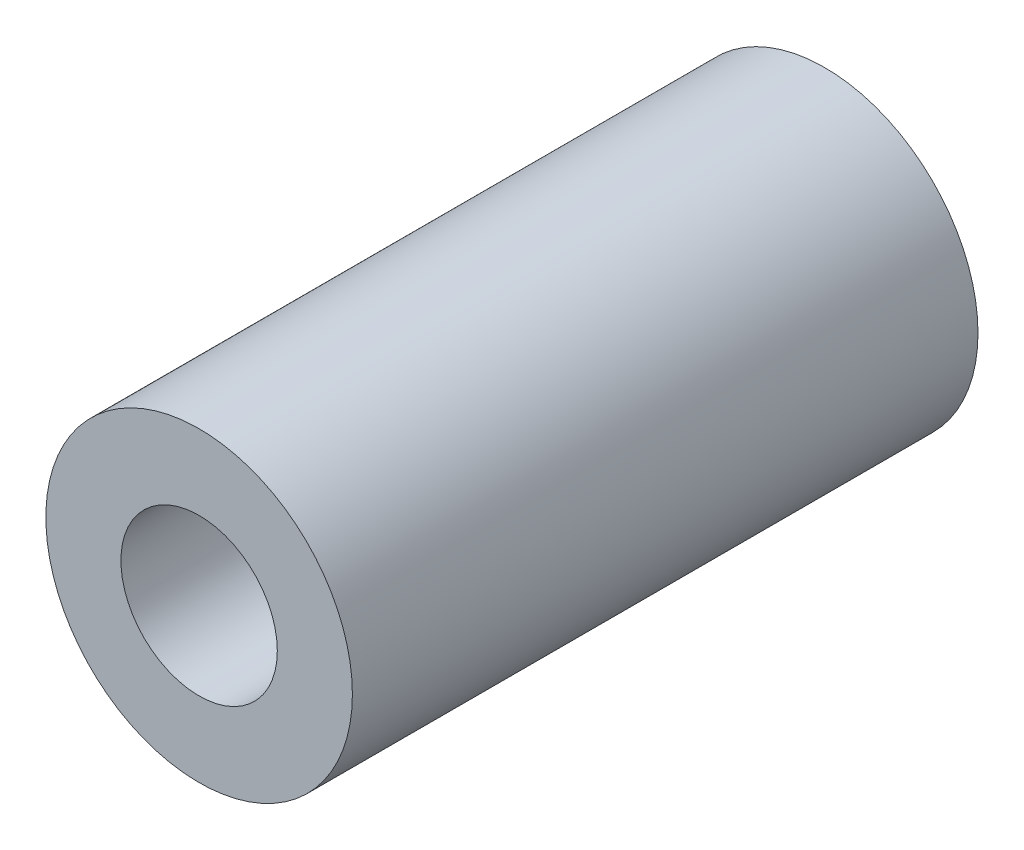
ISO-10303-21;
HEADER;
FILE_DESCRIPTION(('STEP AP214'),'2;1');
FILE_NAME('part.step','',(''),(''),'','','');
FILE_SCHEMA(('AUTOMOTIVE_DESIGN { 1 0 10303 214 1 1 1 1 }'));
ENDSEC;
DATA;
#1=APPLICATION_CONTEXT('core data for automotive mechanical design processes');
#2=APPLICATION_PROTOCOL_DEFINITION('international standard','automotive_design',2000,#1);
#3=PRODUCT_CONTEXT('',#1,'mechanical');
#4=PRODUCT('Part','Part','',(#3));
#5=PRODUCT_RELATED_PRODUCT_CATEGORY('part','',(#4));
#6=PRODUCT_DEFINITION_FORMATION('','',#4);
#7=PRODUCT_DEFINITION_CONTEXT('part definition',#1,'design');
#8=PRODUCT_DEFINITION('design','',#6,#7);
#9=PRODUCT_DEFINITION_SHAPE('','',#8);
#10=(LENGTH_UNIT() NAMED_UNIT(*) SI_UNIT(.MILLI.,.METRE.));
#11=(NAMED_UNIT(*) PLANE_ANGLE_UNIT() SI_UNIT($,.RADIAN.));
#12=(NAMED_UNIT(*) SI_UNIT($,.STERADIAN.) SOLID_ANGLE_UNIT());
#13=UNCERTAINTY_MEASURE_WITH_UNIT(LENGTH_MEASURE(1.E-05),#10,'distance_accuracy_value','');
#14=(GEOMETRIC_REPRESENTATION_CONTEXT(3) GLOBAL_UNCERTAINTY_ASSIGNED_CONTEXT((#13)) GLOBAL_UNIT_ASSIGNED_CONTEXT((#10,
#11,#12)) REPRESENTATION_CONTEXT('',''));
#15=CARTESIAN_POINT('',(0.,0.,0.));
#16=DIRECTION('',(0.,0.,1.));
#17=DIRECTION('',(1.,0.,0.));
#18=AXIS2_PLACEMENT_3D('',#15,#16,#17);
#19=CARTESIAN_POINT('',(0.,0.,10.));
#20=DIRECTION('',(0.,0.,1.));
#21=DIRECTION('',(1.,0.,0.));
#22=AXIS2_PLACEMENT_3D('',#19,#20,#21);
#23=PLANE('',#22);
#24=CARTESIAN_POINT('',(0.,0.,10.));
#25=DIRECTION('',(0.,0.,1.));
#26=DIRECTION('',(1.,0.,0.));
#27=AXIS2_PLACEMENT_3D('',#24,#25,#26);
#28=CIRCLE('',#27,2.45);
#29=CARTESIAN_POINT('',(2.45,0.,10.));
#30=VERTEX_POINT('',#29);
#31=EDGE_CURVE('E10',#30,#30,#28,.T.);
#32=ORIENTED_EDGE('',*,*,#31,.T.);
#33=EDGE_LOOP('',(#32));
#34=FACE_BOUND('',#33,.T.);
#35=CARTESIAN_POINT('',(0.,0.,10.));
#36=DIRECTION('',(0.,0.,1.));
#37=DIRECTION('',(1.,0.,0.));
#38=AXIS2_PLACEMENT_3D('',#35,#36,#37);
#39=CIRCLE('',#38,1.25);
#40=CARTESIAN_POINT('',(1.25,0.,10.));
#41=VERTEX_POINT('',#40);
#42=EDGE_CURVE('E48',#41,#41,#39,.T.);
#43=ORIENTED_EDGE('',*,*,#42,.F.);
#44=EDGE_LOOP('',(#43));
#45=FACE_BOUND('',#44,.T.);
#46=ADVANCED_FACE('F37',(#34,#45),#23,.T.);
#47=CARTESIAN_POINT('',(0.,0.,0.));
#48=DIRECTION('',(0.,0.,1.));
#49=DIRECTION('',(1.,0.,0.));
#50=AXIS2_PLACEMENT_3D('',#47,#48,#49);
#51=PLANE('',#50);
#52=CARTESIAN_POINT('',(0.,0.,0.));
#53=DIRECTION('',(0.,0.,1.));
#54=DIRECTION('',(1.,0.,0.));
#55=AXIS2_PLACEMENT_3D('',#52,#53,#54);
#56=CIRCLE('',#55,2.45);
#57=CARTESIAN_POINT('',(2.45,0.,0.));
#58=VERTEX_POINT('',#57);
#59=EDGE_CURVE('E41',#58,#58,#56,.T.);
#60=ORIENTED_EDGE('',*,*,#59,.F.);
#61=EDGE_LOOP('',(#60));
#62=FACE_BOUND('',#61,.T.);
#63=CARTESIAN_POINT('',(0.,0.,0.));
#64=DIRECTION('',(0.,0.,1.));
#65=DIRECTION('',(1.,0.,0.));
#66=AXIS2_PLACEMENT_3D('',#63,#64,#65);
#67=CIRCLE('',#66,1.25);
#68=CARTESIAN_POINT('',(1.25,0.,0.));
#69=VERTEX_POINT('',#68);
#70=EDGE_CURVE('E50',#69,#69,#67,.T.);
#71=ORIENTED_EDGE('',*,*,#70,.T.);
#72=EDGE_LOOP('',(#71));
#73=FACE_BOUND('',#72,.T.);
#74=ADVANCED_FACE('F60',(#62,#73),#51,.F.);
#75=CARTESIAN_POINT('',(0.,0.,10.));
#76=DIRECTION('',(0.,0.,-1.));
#77=DIRECTION('',(-1.,0.,0.));
#78=AXIS2_PLACEMENT_3D('',#75,#76,#77);
#79=CYLINDRICAL_SURFACE('',#78,2.45);
#80=ORIENTED_EDGE('',*,*,#31,.F.);
#81=EDGE_LOOP('',(#80));
#82=FACE_BOUND('',#81,.T.);
#83=ORIENTED_EDGE('',*,*,#59,.T.);
#84=EDGE_LOOP('',(#83));
#85=FACE_BOUND('',#84,.T.);
#86=ADVANCED_FACE('F39',(#82,#85),#79,.T.);
#87=CARTESIAN_POINT('',(0.,0.,10.));
#88=DIRECTION('',(0.,0.,-1.));
#89=DIRECTION('',(-1.,0.,0.));
#90=AXIS2_PLACEMENT_3D('',#87,#88,#89);
#91=CYLINDRICAL_SURFACE('',#90,1.25);
#92=ORIENTED_EDGE('',*,*,#42,.T.);
#93=EDGE_LOOP('',(#92));
#94=FACE_BOUND('',#93,.T.);
#95=ORIENTED_EDGE('',*,*,#70,.F.);
#96=EDGE_LOOP('',(#95));
#97=FACE_BOUND('',#96,.T.);
#98=ADVANCED_FACE('F56',(#94,#97),#91,.F.);
#99=CLOSED_SHELL('',(#46,#74,#86,#98));
#100=MANIFOLD_SOLID_BREP('B2',#99);
#101=ADVANCED_BREP_SHAPE_REPRESENTATION('',(#18,#100),#14);
#102=SHAPE_DEFINITION_REPRESENTATION(#9,#101);
ENDSEC;
END-ISO-10303-21;
